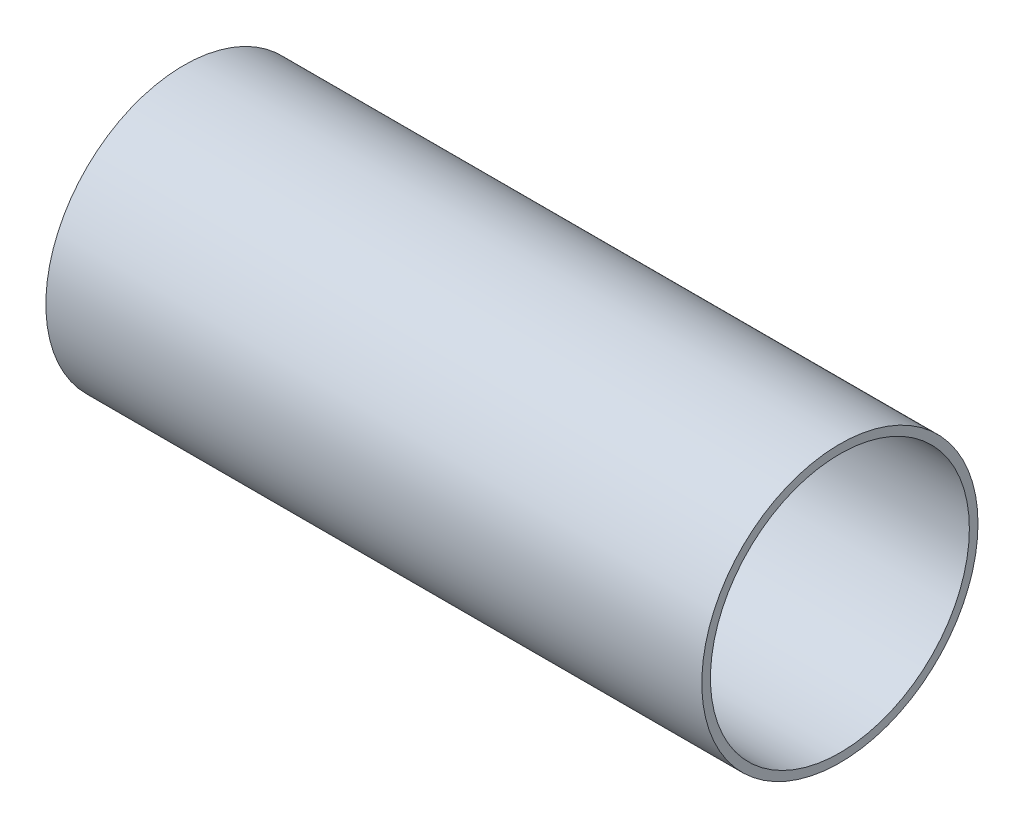
ISO-10303-21;
HEADER;
FILE_DESCRIPTION(('STEP AP214'),'2;1');
FILE_NAME('part.step','',(''),(''),'','','');
FILE_SCHEMA(('AUTOMOTIVE_DESIGN { 1 0 10303 214 1 1 1 1 }'));
ENDSEC;
DATA;
#1=APPLICATION_CONTEXT('core data for automotive mechanical design processes');
#2=APPLICATION_PROTOCOL_DEFINITION('international standard','automotive_design',2000,#1);
#3=PRODUCT_CONTEXT('',#1,'mechanical');
#4=PRODUCT('Part','Part','',(#3));
#5=PRODUCT_RELATED_PRODUCT_CATEGORY('part','',(#4));
#6=PRODUCT_DEFINITION_FORMATION('','',#4);
#7=PRODUCT_DEFINITION_CONTEXT('part definition',#1,'design');
#8=PRODUCT_DEFINITION('design','',#6,#7);
#9=PRODUCT_DEFINITION_SHAPE('','',#8);
#10=(LENGTH_UNIT() NAMED_UNIT(*) SI_UNIT(.MILLI.,.METRE.));
#11=(NAMED_UNIT(*) PLANE_ANGLE_UNIT() SI_UNIT($,.RADIAN.));
#12=(NAMED_UNIT(*) SI_UNIT($,.STERADIAN.) SOLID_ANGLE_UNIT());
#13=UNCERTAINTY_MEASURE_WITH_UNIT(LENGTH_MEASURE(1.E-05),#10,'distance_accuracy_value','');
#14=(GEOMETRIC_REPRESENTATION_CONTEXT(3) GLOBAL_UNCERTAINTY_ASSIGNED_CONTEXT((#13)) GLOBAL_UNIT_ASSIGNED_CONTEXT((#10,
#11,#12)) REPRESENTATION_CONTEXT('',''));
#15=CARTESIAN_POINT('',(0.,0.,0.));
#16=DIRECTION('',(0.,0.,1.));
#17=DIRECTION('',(1.,0.,0.));
#18=AXIS2_PLACEMENT_3D('',#15,#16,#17);
#19=CARTESIAN_POINT('',(482.6,0.,0.));
#20=DIRECTION('',(1.,0.,0.));
#21=DIRECTION('',(0.,0.,-1.));
#22=AXIS2_PLACEMENT_3D('',#19,#20,#21);
#23=PLANE('',#22);
#24=CARTESIAN_POINT('',(482.6,0.,0.));
#25=DIRECTION('',(1.,0.,0.));
#26=DIRECTION('',(0.,0.,-1.));
#27=AXIS2_PLACEMENT_3D('',#24,#25,#26);
#28=CIRCLE('',#27,101.6);
#29=CARTESIAN_POINT('',(482.6,0.,-101.6));
#30=VERTEX_POINT('',#29);
#31=EDGE_CURVE('E10',#30,#30,#28,.T.);
#32=ORIENTED_EDGE('',*,*,#31,.T.);
#33=EDGE_LOOP('',(#32));
#34=FACE_BOUND('',#33,.T.);
#35=CARTESIAN_POINT('',(482.6,0.,0.));
#36=DIRECTION('',(1.,0.,0.));
#37=DIRECTION('',(0.,0.,-1.));
#38=AXIS2_PLACEMENT_3D('',#35,#36,#37);
#39=CIRCLE('',#38,95.25);
#40=CARTESIAN_POINT('',(482.6,0.,-95.25));
#41=VERTEX_POINT('',#40);
#42=EDGE_CURVE('E48',#41,#41,#39,.T.);
#43=ORIENTED_EDGE('',*,*,#42,.F.);
#44=EDGE_LOOP('',(#43));
#45=FACE_BOUND('',#44,.T.);
#46=ADVANCED_FACE('F37',(#34,#45),#23,.T.);
#47=CARTESIAN_POINT('',(0.,0.,0.));
#48=DIRECTION('',(1.,0.,0.));
#49=DIRECTION('',(0.,0.,-1.));
#50=AXIS2_PLACEMENT_3D('',#47,#48,#49);
#51=PLANE('',#50);
#52=CARTESIAN_POINT('',(0.,0.,0.));
#53=DIRECTION('',(1.,0.,0.));
#54=DIRECTION('',(0.,0.,-1.));
#55=AXIS2_PLACEMENT_3D('',#52,#53,#54);
#56=CIRCLE('',#55,101.6);
#57=CARTESIAN_POINT('',(0.,0.,-101.6));
#58=VERTEX_POINT('',#57);
#59=EDGE_CURVE('E41',#58,#58,#56,.T.);
#60=ORIENTED_EDGE('',*,*,#59,.F.);
#61=EDGE_LOOP('',(#60));
#62=FACE_BOUND('',#61,.T.);
#63=CARTESIAN_POINT('',(0.,0.,0.));
#64=DIRECTION('',(1.,0.,0.));
#65=DIRECTION('',(0.,0.,-1.));
#66=AXIS2_PLACEMENT_3D('',#63,#64,#65);
#67=CIRCLE('',#66,95.25);
#68=CARTESIAN_POINT('',(0.,0.,-95.25));
#69=VERTEX_POINT('',#68);
#70=EDGE_CURVE('E50',#69,#69,#67,.T.);
#71=ORIENTED_EDGE('',*,*,#70,.T.);
#72=EDGE_LOOP('',(#71));
#73=FACE_BOUND('',#72,.T.);
#74=ADVANCED_FACE('F60',(#62,#73),#51,.F.);
#75=CARTESIAN_POINT('',(482.6,0.,0.));
#76=DIRECTION('',(-1.,0.,0.));
#77=DIRECTION('',(0.,0.,1.));
#78=AXIS2_PLACEMENT_3D('',#75,#76,#77);
#79=CYLINDRICAL_SURFACE('',#78,101.6);
#80=ORIENTED_EDGE('',*,*,#31,.F.);
#81=EDGE_LOOP('',(#80));
#82=FACE_BOUND('',#81,.T.);
#83=ORIENTED_EDGE('',*,*,#59,.T.);
#84=EDGE_LOOP('',(#83));
#85=FACE_BOUND('',#84,.T.);
#86=ADVANCED_FACE('F39',(#82,#85),#79,.T.);
#87=CARTESIAN_POINT('',(482.6,0.,0.));
#88=DIRECTION('',(-1.,0.,0.));
#89=DIRECTION('',(0.,0.,1.));
#90=AXIS2_PLACEMENT_3D('',#87,#88,#89);
#91=CYLINDRICAL_SURFACE('',#90,95.25);
#92=ORIENTED_EDGE('',*,*,#42,.T.);
#93=EDGE_LOOP('',(#92));
#94=FACE_BOUND('',#93,.T.);
#95=ORIENTED_EDGE('',*,*,#70,.F.);
#96=EDGE_LOOP('',(#95));
#97=FACE_BOUND('',#96,.T.);
#98=ADVANCED_FACE('F56',(#94,#97),#91,.F.);
#99=CLOSED_SHELL('',(#46,#74,#86,#98));
#100=MANIFOLD_SOLID_BREP('B2',#99);
#101=ADVANCED_BREP_SHAPE_REPRESENTATION('',(#18,#100),#14);
#102=SHAPE_DEFINITION_REPRESENTATION(#9,#101);
ENDSEC;
END-ISO-10303-21;
